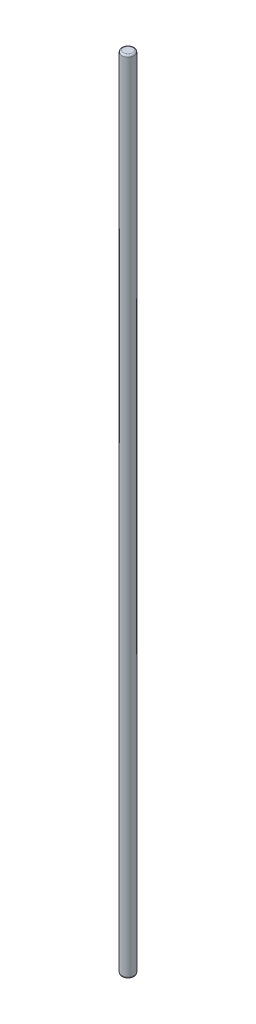
ISO-10303-21;
HEADER;
FILE_DESCRIPTION(('STEP AP214'),'2;1');
FILE_NAME('part.step','',(''),(''),'','','');
FILE_SCHEMA(('AUTOMOTIVE_DESIGN { 1 0 10303 214 1 1 1 1 }'));
ENDSEC;
DATA;
#1=APPLICATION_CONTEXT('core data for automotive mechanical design processes');
#2=APPLICATION_PROTOCOL_DEFINITION('international standard','automotive_design',2000,#1);
#3=PRODUCT_CONTEXT('',#1,'mechanical');
#4=PRODUCT('Part','Part','',(#3));
#5=PRODUCT_RELATED_PRODUCT_CATEGORY('part','',(#4));
#6=PRODUCT_DEFINITION_FORMATION('','',#4);
#7=PRODUCT_DEFINITION_CONTEXT('part definition',#1,'design');
#8=PRODUCT_DEFINITION('design','',#6,#7);
#9=PRODUCT_DEFINITION_SHAPE('','',#8);
#10=(LENGTH_UNIT() NAMED_UNIT(*) SI_UNIT(.MILLI.,.METRE.));
#11=(NAMED_UNIT(*) PLANE_ANGLE_UNIT() SI_UNIT($,.RADIAN.));
#12=(NAMED_UNIT(*) SI_UNIT($,.STERADIAN.) SOLID_ANGLE_UNIT());
#13=UNCERTAINTY_MEASURE_WITH_UNIT(LENGTH_MEASURE(1.E-05),#10,'distance_accuracy_value','');
#14=(GEOMETRIC_REPRESENTATION_CONTEXT(3) GLOBAL_UNCERTAINTY_ASSIGNED_CONTEXT((#13)) GLOBAL_UNIT_ASSIGNED_CONTEXT((#10,
#11,#12)) REPRESENTATION_CONTEXT('',''));
#15=CARTESIAN_POINT('',(0.,0.,0.));
#16=DIRECTION('',(0.,0.,1.));
#17=DIRECTION('',(1.,0.,0.));
#18=AXIS2_PLACEMENT_3D('',#15,#16,#17);
#19=CARTESIAN_POINT('',(0.,1450.,0.));
#20=DIRECTION('',(0.,-1.,0.));
#21=DIRECTION('',(0.,0.,-1.));
#22=AXIS2_PLACEMENT_3D('',#19,#20,#21);
#23=CYLINDRICAL_SURFACE('',#22,11.25);
#24=CARTESIAN_POINT('',(0.,2.99999999999989,0.));
#25=DIRECTION('',(0.,1.,0.));
#26=DIRECTION('',(0.,0.,1.));
#27=AXIS2_PLACEMENT_3D('',#24,#25,#26);
#28=CIRCLE('',#27,11.25);
#29=CARTESIAN_POINT('',(0.,2.99999999999989,11.25));
#30=VERTEX_POINT('',#29);
#31=EDGE_CURVE('E42',#30,#30,#28,.T.);
#32=ORIENTED_EDGE('',*,*,#31,.T.);
#33=EDGE_LOOP('',(#32));
#34=FACE_BOUND('',#33,.T.);
#35=CARTESIAN_POINT('',(0.,1447.,0.));
#36=DIRECTION('',(0.,1.,0.));
#37=DIRECTION('',(0.,0.,1.));
#38=AXIS2_PLACEMENT_3D('',#35,#36,#37);
#39=CIRCLE('',#38,11.25);
#40=CARTESIAN_POINT('',(0.,1447.,11.25));
#41=VERTEX_POINT('',#40);
#42=EDGE_CURVE('E46',#41,#41,#39,.F.);
#43=ORIENTED_EDGE('',*,*,#42,.T.);
#44=EDGE_LOOP('',(#43));
#45=FACE_BOUND('',#44,.T.);
#46=ADVANCED_FACE('F31',(#34,#45),#23,.T.);
#47=CARTESIAN_POINT('',(0.,1450.,0.));
#48=DIRECTION('',(0.,1.,0.));
#49=DIRECTION('',(0.,0.,1.));
#50=AXIS2_PLACEMENT_3D('',#47,#48,#49);
#51=PLANE('',#50);
#52=CARTESIAN_POINT('',(0.,1450.,0.));
#53=DIRECTION('',(0.,1.,0.));
#54=DIRECTION('',(0.,0.,1.));
#55=AXIS2_PLACEMENT_3D('',#52,#53,#54);
#56=CIRCLE('',#55,8.25);
#57=CARTESIAN_POINT('',(0.,1450.,8.25));
#58=VERTEX_POINT('',#57);
#59=EDGE_CURVE('E10',#58,#58,#56,.T.);
#60=ORIENTED_EDGE('',*,*,#59,.T.);
#61=EDGE_LOOP('',(#60));
#62=FACE_BOUND('',#61,.T.);
#63=ADVANCED_FACE('F62',(#62),#51,.T.);
#64=CARTESIAN_POINT('',(0.,0.,0.));
#65=DIRECTION('',(0.,1.,0.));
#66=DIRECTION('',(0.,0.,1.));
#67=AXIS2_PLACEMENT_3D('',#64,#65,#66);
#68=PLANE('',#67);
#69=CARTESIAN_POINT('',(0.,0.,0.));
#70=DIRECTION('',(0.,1.,0.));
#71=DIRECTION('',(0.,0.,1.));
#72=AXIS2_PLACEMENT_3D('',#69,#70,#71);
#73=CIRCLE('',#72,8.25);
#74=CARTESIAN_POINT('',(0.,0.,8.25));
#75=VERTEX_POINT('',#74);
#76=EDGE_CURVE('E38',#75,#75,#73,.F.);
#77=ORIENTED_EDGE('',*,*,#76,.T.);
#78=EDGE_LOOP('',(#77));
#79=FACE_BOUND('',#78,.T.);
#80=ADVANCED_FACE('F59',(#79),#68,.F.);
#81=CARTESIAN_POINT('',(0.,2.99999999999989,0.));
#82=DIRECTION('',(0.,1.,0.));
#83=DIRECTION('',(0.,0.,1.));
#84=AXIS2_PLACEMENT_3D('',#81,#82,#83);
#85=TOROIDAL_SURFACE('',#84,8.25,3.);
#86=ORIENTED_EDGE('',*,*,#76,.F.);
#87=EDGE_LOOP('',(#86));
#88=FACE_BOUND('',#87,.T.);
#89=ORIENTED_EDGE('',*,*,#31,.F.);
#90=EDGE_LOOP('',(#89));
#91=FACE_BOUND('',#90,.T.);
#92=ADVANCED_FACE('F55',(#88,#91),#85,.T.);
#93=CARTESIAN_POINT('',(0.,1447.,0.));
#94=DIRECTION('',(0.,1.,0.));
#95=DIRECTION('',(0.,0.,1.));
#96=AXIS2_PLACEMENT_3D('',#93,#94,#95);
#97=TOROIDAL_SURFACE('',#96,8.25,3.);
#98=ORIENTED_EDGE('',*,*,#42,.F.);
#99=EDGE_LOOP('',(#98));
#100=FACE_BOUND('',#99,.T.);
#101=ORIENTED_EDGE('',*,*,#59,.F.);
#102=EDGE_LOOP('',(#101));
#103=FACE_BOUND('',#102,.T.);
#104=ADVANCED_FACE('F33',(#100,#103),#97,.T.);
#105=CLOSED_SHELL('',(#46,#63,#80,#92,#104));
#106=MANIFOLD_SOLID_BREP('B2',#105);
#107=ADVANCED_BREP_SHAPE_REPRESENTATION('',(#18,#106),#14);
#108=SHAPE_DEFINITION_REPRESENTATION(#9,#107);
ENDSEC;
END-ISO-10303-21;
